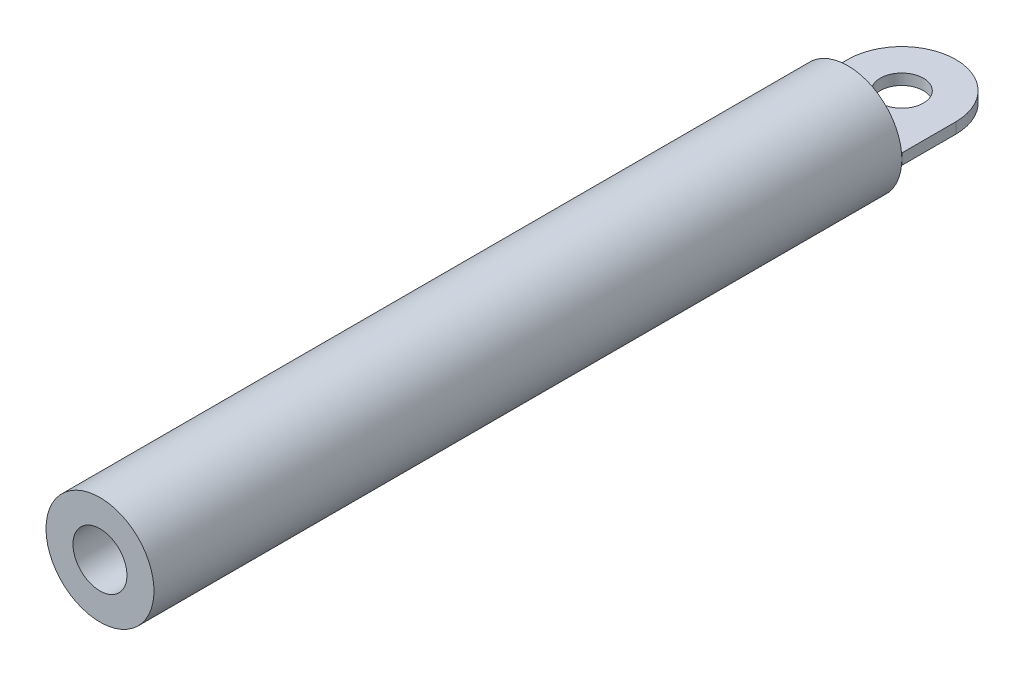
ISO-10303-21;
HEADER;
FILE_DESCRIPTION(('STEP AP214'),'2;1');
FILE_NAME('part.step','',(''),(''),'','','');
FILE_SCHEMA(('AUTOMOTIVE_DESIGN { 1 0 10303 214 1 1 1 1 }'));
ENDSEC;
DATA;
#1=APPLICATION_CONTEXT('core data for automotive mechanical design processes');
#2=APPLICATION_PROTOCOL_DEFINITION('international standard','automotive_design',2000,#1);
#3=PRODUCT_CONTEXT('',#1,'mechanical');
#4=PRODUCT('Part','Part','',(#3));
#5=PRODUCT_RELATED_PRODUCT_CATEGORY('part','',(#4));
#6=PRODUCT_DEFINITION_FORMATION('','',#4);
#7=PRODUCT_DEFINITION_CONTEXT('part definition',#1,'design');
#8=PRODUCT_DEFINITION('design','',#6,#7);
#9=PRODUCT_DEFINITION_SHAPE('','',#8);
#10=(LENGTH_UNIT() NAMED_UNIT(*) SI_UNIT(.MILLI.,.METRE.));
#11=(NAMED_UNIT(*) PLANE_ANGLE_UNIT() SI_UNIT($,.RADIAN.));
#12=(NAMED_UNIT(*) SI_UNIT($,.STERADIAN.) SOLID_ANGLE_UNIT());
#13=UNCERTAINTY_MEASURE_WITH_UNIT(LENGTH_MEASURE(1.E-05),#10,'distance_accuracy_value','');
#14=(GEOMETRIC_REPRESENTATION_CONTEXT(3) GLOBAL_UNCERTAINTY_ASSIGNED_CONTEXT((#13)) GLOBAL_UNIT_ASSIGNED_CONTEXT((#10,
#11,#12)) REPRESENTATION_CONTEXT('',''));
#15=CARTESIAN_POINT('',(0.,0.,0.));
#16=DIRECTION('',(0.,0.,1.));
#17=DIRECTION('',(1.,0.,0.));
#18=AXIS2_PLACEMENT_3D('',#15,#16,#17);
#19=CARTESIAN_POINT('',(0.,0.,3.175));
#20=DIRECTION('',(0.,0.,-1.));
#21=DIRECTION('',(-1.,0.,0.));
#22=AXIS2_PLACEMENT_3D('',#19,#20,#21);
#23=PLANE('',#22);
#24=CARTESIAN_POINT('',(0.,0.,3.175));
#25=DIRECTION('',(0.,0.,-1.));
#26=DIRECTION('',(-1.,0.,0.));
#27=AXIS2_PLACEMENT_3D('',#24,#25,#26);
#28=CIRCLE('',#27,3.175);
#29=CARTESIAN_POINT('',(3.15908511281352,-0.3175,3.175));
#30=VERTEX_POINT('',#29);
#31=CARTESIAN_POINT('',(-3.15908511281352,-0.3175,3.175));
#32=VERTEX_POINT('',#31);
#33=EDGE_CURVE('E209',#30,#32,#28,.T.);
#34=ORIENTED_EDGE('',*,*,#33,.T.);
#35=DIRECTION('',(1.,0.,0.));
#36=VECTOR('',#35,1.);
#37=CARTESIAN_POINT('',(0.,-0.3175,3.175));
#38=LINE('',#37,#36);
#39=CARTESIAN_POINT('',(-1.55542598666732,-0.3175,3.175));
#40=VERTEX_POINT('',#39);
#41=EDGE_CURVE('E11',#32,#40,#38,.T.);
#42=ORIENTED_EDGE('',*,*,#41,.T.);
#43=CARTESIAN_POINT('',(0.,0.,3.175));
#44=DIRECTION('',(0.,0.,-1.));
#45=DIRECTION('',(-1.,0.,0.));
#46=AXIS2_PLACEMENT_3D('',#43,#44,#45);
#47=CIRCLE('',#46,1.5875);
#48=CARTESIAN_POINT('',(1.55542598666732,-0.3175,3.175));
#49=VERTEX_POINT('',#48);
#50=EDGE_CURVE('E62',#49,#40,#47,.T.);
#51=ORIENTED_EDGE('',*,*,#50,.F.);
#52=EDGE_CURVE('E51',#49,#30,#38,.T.);
#53=ORIENTED_EDGE('',*,*,#52,.T.);
#54=EDGE_LOOP('',(#34,#42,#51,#53));
#55=FACE_BOUND('',#54,.T.);
#56=ADVANCED_FACE('F41',(#55),#23,.T.);
#57=CARTESIAN_POINT('',(0.,0.,0.));
#58=DIRECTION('',(0.,0.,-1.));
#59=DIRECTION('',(-1.,0.,0.));
#60=AXIS2_PLACEMENT_3D('',#57,#58,#59);
#61=CYLINDRICAL_SURFACE('',#60,1.5875);
#62=CARTESIAN_POINT('',(-1.55542598666732,0.3175,3.175));
#63=VERTEX_POINT('',#62);
#64=CARTESIAN_POINT('',(1.55542598666732,0.3175,3.175));
#65=VERTEX_POINT('',#64);
#66=EDGE_CURVE('E45',#63,#65,#47,.T.);
#67=ORIENTED_EDGE('',*,*,#66,.T.);
#68=EDGE_CURVE('E292',#65,#49,#47,.T.);
#69=ORIENTED_EDGE('',*,*,#68,.T.);
#70=ORIENTED_EDGE('',*,*,#50,.T.);
#71=EDGE_CURVE('E199',#40,#63,#47,.T.);
#72=ORIENTED_EDGE('',*,*,#71,.T.);
#73=EDGE_LOOP('',(#67,#69,#70,#72));
#74=FACE_BOUND('',#73,.T.);
#75=CARTESIAN_POINT('',(0.,0.,47.169090574));
#76=DIRECTION('',(0.,0.,-1.));
#77=DIRECTION('',(-1.,0.,0.));
#78=AXIS2_PLACEMENT_3D('',#75,#76,#77);
#79=CIRCLE('',#78,1.5875);
#80=CARTESIAN_POINT('',(-1.5875,0.,47.169090574));
#81=VERTEX_POINT('',#80);
#82=EDGE_CURVE('E188',#81,#81,#79,.T.);
#83=ORIENTED_EDGE('',*,*,#82,.F.);
#84=EDGE_LOOP('',(#83));
#85=FACE_BOUND('',#84,.T.);
#86=ADVANCED_FACE('F43',(#74,#85),#61,.F.);
#87=DIRECTION('',(1.,0.,0.));
#88=VECTOR('',#87,1.);
#89=CARTESIAN_POINT('',(0.,0.3175,3.175));
#90=LINE('',#89,#88);
#91=CARTESIAN_POINT('',(-3.15908511281352,0.3175,3.175));
#92=VERTEX_POINT('',#91);
#93=EDGE_CURVE('E229',#92,#63,#90,.T.);
#94=ORIENTED_EDGE('',*,*,#93,.F.);
#95=CARTESIAN_POINT('',(3.15908511281352,0.3175,3.175));
#96=VERTEX_POINT('',#95);
#97=EDGE_CURVE('E200',#92,#96,#28,.T.);
#98=ORIENTED_EDGE('',*,*,#97,.T.);
#99=EDGE_CURVE('E164',#65,#96,#90,.T.);
#100=ORIENTED_EDGE('',*,*,#99,.F.);
#101=ORIENTED_EDGE('',*,*,#66,.F.);
#102=EDGE_LOOP('',(#94,#98,#100,#101));
#103=FACE_BOUND('',#102,.T.);
#104=ADVANCED_FACE('F226',(#103),#23,.T.);
#105=CARTESIAN_POINT('',(0.,0.,0.));
#106=DIRECTION('',(0.,0.,-1.));
#107=DIRECTION('',(-1.,0.,0.));
#108=AXIS2_PLACEMENT_3D('',#105,#106,#107);
#109=CYLINDRICAL_SURFACE('',#108,3.175);
#110=CARTESIAN_POINT('',(0.,0.,47.169090574));
#111=DIRECTION('',(0.,0.,-1.));
#112=DIRECTION('',(-1.,0.,0.));
#113=AXIS2_PLACEMENT_3D('',#110,#111,#112);
#114=CIRCLE('',#113,3.175);
#115=CARTESIAN_POINT('',(-3.175,0.,47.169090574));
#116=VERTEX_POINT('',#115);
#117=EDGE_CURVE('E192',#116,#116,#114,.T.);
#118=ORIENTED_EDGE('',*,*,#117,.T.);
#119=EDGE_LOOP('',(#118));
#120=FACE_BOUND('',#119,.T.);
#121=CARTESIAN_POINT('',(-3.175,0.,3.175));
#122=VERTEX_POINT('',#121);
#123=EDGE_CURVE('E196',#122,#92,#28,.T.);
#124=ORIENTED_EDGE('',*,*,#123,.F.);
#125=EDGE_CURVE('E195',#32,#122,#28,.T.);
#126=ORIENTED_EDGE('',*,*,#125,.F.);
#127=ORIENTED_EDGE('',*,*,#33,.F.);
#128=CARTESIAN_POINT('',(3.175,0.,3.175));
#129=VERTEX_POINT('',#128);
#130=EDGE_CURVE('E131',#129,#30,#28,.T.);
#131=ORIENTED_EDGE('',*,*,#130,.F.);
#132=EDGE_CURVE('E206',#96,#129,#28,.T.);
#133=ORIENTED_EDGE('',*,*,#132,.F.);
#134=ORIENTED_EDGE('',*,*,#97,.F.);
#135=EDGE_LOOP('',(#124,#126,#127,#131,#133,#134));
#136=FACE_BOUND('',#135,.T.);
#137=ADVANCED_FACE('F224',(#120,#136),#109,.T.);
#138=CARTESIAN_POINT('',(0.,0.,47.169090574));
#139=DIRECTION('',(0.,0.,1.));
#140=DIRECTION('',(1.,0.,0.));
#141=AXIS2_PLACEMENT_3D('',#138,#139,#140);
#142=PLANE('',#141);
#143=ORIENTED_EDGE('',*,*,#82,.T.);
#144=EDGE_LOOP('',(#143));
#145=FACE_BOUND('',#144,.T.);
#146=ORIENTED_EDGE('',*,*,#117,.F.);
#147=EDGE_LOOP('',(#146));
#148=FACE_BOUND('',#147,.T.);
#149=ADVANCED_FACE('F270',(#145,#148),#142,.T.);
#150=CARTESIAN_POINT('',(0.,0.3175,3.175));
#151=DIRECTION('',(0.,0.,-1.));
#152=DIRECTION('',(-1.,0.,0.));
#153=AXIS2_PLACEMENT_3D('',#150,#151,#152);
#154=PLANE('',#153);
#155=CARTESIAN_POINT('',(3.175,0.3175,3.175));
#156=VERTEX_POINT('',#155);
#157=EDGE_CURVE('E157',#96,#156,#90,.T.);
#158=ORIENTED_EDGE('',*,*,#157,.F.);
#159=ORIENTED_EDGE('',*,*,#132,.T.);
#160=DIRECTION('',(0.,-1.,0.));
#161=VECTOR('',#160,1.);
#162=CARTESIAN_POINT('',(3.175,0.3175,3.175));
#163=LINE('',#162,#161);
#164=EDGE_CURVE('E122',#156,#129,#163,.T.);
#165=ORIENTED_EDGE('',*,*,#164,.F.);
#166=EDGE_LOOP('',(#158,#159,#165));
#167=FACE_BOUND('',#166,.T.);
#168=ADVANCED_FACE('F220',(#167),#154,.F.);
#169=CARTESIAN_POINT('',(3.175,-0.3175,3.175));
#170=VERTEX_POINT('',#169);
#171=EDGE_CURVE('E114',#129,#170,#163,.T.);
#172=ORIENTED_EDGE('',*,*,#171,.F.);
#173=ORIENTED_EDGE('',*,*,#130,.T.);
#174=EDGE_CURVE('E129',#30,#170,#38,.T.);
#175=ORIENTED_EDGE('',*,*,#174,.T.);
#176=EDGE_LOOP('',(#172,#173,#175));
#177=FACE_BOUND('',#176,.T.);
#178=ADVANCED_FACE('F130',(#177),#154,.F.);
#179=DIRECTION('',(0.,-1.,0.));
#180=VECTOR('',#179,1.);
#181=CARTESIAN_POINT('',(-3.175,0.3175,3.175));
#182=LINE('',#181,#180);
#183=CARTESIAN_POINT('',(-3.175,0.3175,3.175));
#184=VERTEX_POINT('',#183);
#185=EDGE_CURVE('E178',#184,#122,#182,.T.);
#186=ORIENTED_EDGE('',*,*,#185,.T.);
#187=ORIENTED_EDGE('',*,*,#123,.T.);
#188=EDGE_CURVE('E158',#184,#92,#90,.T.);
#189=ORIENTED_EDGE('',*,*,#188,.F.);
#190=EDGE_LOOP('',(#186,#187,#189));
#191=FACE_BOUND('',#190,.T.);
#192=ADVANCED_FACE('F249',(#191),#154,.F.);
#193=CARTESIAN_POINT('',(-3.175,-0.3175,3.175));
#194=VERTEX_POINT('',#193);
#195=EDGE_CURVE('E135',#194,#32,#38,.T.);
#196=ORIENTED_EDGE('',*,*,#195,.T.);
#197=ORIENTED_EDGE('',*,*,#125,.T.);
#198=EDGE_CURVE('E177',#122,#194,#182,.T.);
#199=ORIENTED_EDGE('',*,*,#198,.T.);
#200=EDGE_LOOP('',(#196,#197,#199));
#201=FACE_BOUND('',#200,.T.);
#202=ADVANCED_FACE('F251',(#201),#154,.F.);
#203=ORIENTED_EDGE('',*,*,#68,.F.);
#204=EDGE_CURVE('E163',#63,#65,#90,.T.);
#205=ORIENTED_EDGE('',*,*,#204,.F.);
#206=ORIENTED_EDGE('',*,*,#71,.F.);
#207=EDGE_CURVE('E53',#40,#49,#38,.T.);
#208=ORIENTED_EDGE('',*,*,#207,.T.);
#209=EDGE_LOOP('',(#203,#205,#206,#208));
#210=FACE_BOUND('',#209,.T.);
#211=ADVANCED_FACE('F257',(#210),#154,.F.);
#212=CARTESIAN_POINT('',(3.175,0.3175,0.));
#213=DIRECTION('',(1.,0.,0.));
#214=DIRECTION('',(0.,0.,-1.));
#215=AXIS2_PLACEMENT_3D('',#212,#213,#214);
#216=PLANE('',#215);
#217=ORIENTED_EDGE('',*,*,#164,.T.);
#218=ORIENTED_EDGE('',*,*,#171,.T.);
#219=DIRECTION('',(0.,0.,1.));
#220=VECTOR('',#219,1.);
#221=CARTESIAN_POINT('',(3.175,-0.3175,0.));
#222=LINE('',#221,#220);
#223=CARTESIAN_POINT('',(3.175,-0.3175,0.));
#224=VERTEX_POINT('',#223);
#225=EDGE_CURVE('E118',#224,#170,#222,.T.);
#226=ORIENTED_EDGE('',*,*,#225,.F.);
#227=DIRECTION('',(0.,-1.,0.));
#228=VECTOR('',#227,1.);
#229=CARTESIAN_POINT('',(3.175,0.3175,0.));
#230=LINE('',#229,#228);
#231=CARTESIAN_POINT('',(3.175,0.3175,0.));
#232=VERTEX_POINT('',#231);
#233=EDGE_CURVE('E126',#232,#224,#230,.T.);
#234=ORIENTED_EDGE('',*,*,#233,.F.);
#235=DIRECTION('',(0.,0.,1.));
#236=VECTOR('',#235,1.);
#237=CARTESIAN_POINT('',(3.175,0.3175,0.));
#238=LINE('',#237,#236);
#239=EDGE_CURVE('E162',#232,#156,#238,.T.);
#240=ORIENTED_EDGE('',*,*,#239,.T.);
#241=EDGE_LOOP('',(#217,#218,#226,#234,#240));
#242=FACE_BOUND('',#241,.T.);
#243=ADVANCED_FACE('F116',(#242),#216,.T.);
#244=CARTESIAN_POINT('',(0.,0.3175,0.));
#245=DIRECTION('',(0.,-1.,0.));
#246=DIRECTION('',(0.,0.,-1.));
#247=AXIS2_PLACEMENT_3D('',#244,#245,#246);
#248=CYLINDRICAL_SURFACE('',#247,3.175);
#249=ORIENTED_EDGE('',*,*,#233,.T.);
#250=CARTESIAN_POINT('',(0.,-0.3175,0.));
#251=DIRECTION('',(0.,1.,0.));
#252=DIRECTION('',(0.,0.,1.));
#253=AXIS2_PLACEMENT_3D('',#250,#251,#252);
#254=CIRCLE('',#253,3.175);
#255=CARTESIAN_POINT('',(-3.175,-0.3175,0.));
#256=VERTEX_POINT('',#255);
#257=EDGE_CURVE('E141',#224,#256,#254,.T.);
#258=ORIENTED_EDGE('',*,*,#257,.T.);
#259=DIRECTION('',(0.,-1.,0.));
#260=VECTOR('',#259,1.);
#261=CARTESIAN_POINT('',(-3.175,0.3175,0.));
#262=LINE('',#261,#260);
#263=CARTESIAN_POINT('',(-3.175,0.3175,0.));
#264=VERTEX_POINT('',#263);
#265=EDGE_CURVE('E182',#264,#256,#262,.T.);
#266=ORIENTED_EDGE('',*,*,#265,.F.);
#267=CARTESIAN_POINT('',(0.,0.3175,0.));
#268=DIRECTION('',(0.,1.,0.));
#269=DIRECTION('',(0.,0.,1.));
#270=AXIS2_PLACEMENT_3D('',#267,#268,#269);
#271=CIRCLE('',#270,3.175);
#272=EDGE_CURVE('E167',#232,#264,#271,.T.);
#273=ORIENTED_EDGE('',*,*,#272,.F.);
#274=EDGE_LOOP('',(#249,#258,#266,#273));
#275=FACE_BOUND('',#274,.T.);
#276=ADVANCED_FACE('F244',(#275),#248,.T.);
#277=CARTESIAN_POINT('',(-3.175,0.3175,0.));
#278=DIRECTION('',(1.,0.,0.));
#279=DIRECTION('',(0.,0.,-1.));
#280=AXIS2_PLACEMENT_3D('',#277,#278,#279);
#281=PLANE('',#280);
#282=ORIENTED_EDGE('',*,*,#265,.T.);
#283=DIRECTION('',(0.,0.,1.));
#284=VECTOR('',#283,1.);
#285=CARTESIAN_POINT('',(-3.175,-0.3175,0.));
#286=LINE('',#285,#284);
#287=EDGE_CURVE('E146',#256,#194,#286,.T.);
#288=ORIENTED_EDGE('',*,*,#287,.T.);
#289=ORIENTED_EDGE('',*,*,#198,.F.);
#290=ORIENTED_EDGE('',*,*,#185,.F.);
#291=DIRECTION('',(0.,0.,1.));
#292=VECTOR('',#291,1.);
#293=CARTESIAN_POINT('',(-3.175,0.3175,0.));
#294=LINE('',#293,#292);
#295=EDGE_CURVE('E170',#264,#184,#294,.T.);
#296=ORIENTED_EDGE('',*,*,#295,.F.);
#297=EDGE_LOOP('',(#282,#288,#289,#290,#296));
#298=FACE_BOUND('',#297,.T.);
#299=ADVANCED_FACE('F248',(#298),#281,.F.);
#300=CARTESIAN_POINT('',(0.,0.3175,0.));
#301=DIRECTION('',(0.,-1.,0.));
#302=DIRECTION('',(0.,0.,-1.));
#303=AXIS2_PLACEMENT_3D('',#300,#301,#302);
#304=CYLINDRICAL_SURFACE('',#303,1.27);
#305=CARTESIAN_POINT('',(0.,0.3175,0.));
#306=DIRECTION('',(0.,1.,0.));
#307=DIRECTION('',(0.,0.,1.));
#308=AXIS2_PLACEMENT_3D('',#305,#306,#307);
#309=CIRCLE('',#308,1.27);
#310=CARTESIAN_POINT('',(0.,0.3175,1.27));
#311=VERTEX_POINT('',#310);
#312=EDGE_CURVE('E173',#311,#311,#309,.T.);
#313=ORIENTED_EDGE('',*,*,#312,.T.);
#314=EDGE_LOOP('',(#313));
#315=FACE_BOUND('',#314,.T.);
#316=CARTESIAN_POINT('',(0.,-0.3175,0.));
#317=DIRECTION('',(0.,1.,0.));
#318=DIRECTION('',(0.,0.,1.));
#319=AXIS2_PLACEMENT_3D('',#316,#317,#318);
#320=CIRCLE('',#319,1.27);
#321=CARTESIAN_POINT('',(0.,-0.3175,1.27));
#322=VERTEX_POINT('',#321);
#323=EDGE_CURVE('E153',#322,#322,#320,.T.);
#324=ORIENTED_EDGE('',*,*,#323,.F.);
#325=EDGE_LOOP('',(#324));
#326=FACE_BOUND('',#325,.T.);
#327=ADVANCED_FACE('F307',(#315,#326),#304,.F.);
#328=CARTESIAN_POINT('',(0.,0.3175,0.));
#329=DIRECTION('',(0.,1.,0.));
#330=DIRECTION('',(0.,0.,1.));
#331=AXIS2_PLACEMENT_3D('',#328,#329,#330);
#332=PLANE('',#331);
#333=ORIENTED_EDGE('',*,*,#188,.T.);
#334=ORIENTED_EDGE('',*,*,#93,.T.);
#335=ORIENTED_EDGE('',*,*,#204,.T.);
#336=ORIENTED_EDGE('',*,*,#99,.T.);
#337=ORIENTED_EDGE('',*,*,#157,.T.);
#338=ORIENTED_EDGE('',*,*,#239,.F.);
#339=ORIENTED_EDGE('',*,*,#272,.T.);
#340=ORIENTED_EDGE('',*,*,#295,.T.);
#341=EDGE_LOOP('',(#333,#334,#335,#336,#337,#338,#339,#340));
#342=FACE_BOUND('',#341,.T.);
#343=ORIENTED_EDGE('',*,*,#312,.F.);
#344=EDGE_LOOP('',(#343));
#345=FACE_BOUND('',#344,.T.);
#346=ADVANCED_FACE('F239',(#342,#345),#332,.T.);
#347=CARTESIAN_POINT('',(0.,-0.3175,0.));
#348=DIRECTION('',(0.,1.,0.));
#349=DIRECTION('',(0.,0.,1.));
#350=AXIS2_PLACEMENT_3D('',#347,#348,#349);
#351=PLANE('',#350);
#352=ORIENTED_EDGE('',*,*,#195,.F.);
#353=ORIENTED_EDGE('',*,*,#287,.F.);
#354=ORIENTED_EDGE('',*,*,#257,.F.);
#355=ORIENTED_EDGE('',*,*,#225,.T.);
#356=ORIENTED_EDGE('',*,*,#174,.F.);
#357=ORIENTED_EDGE('',*,*,#52,.F.);
#358=ORIENTED_EDGE('',*,*,#207,.F.);
#359=ORIENTED_EDGE('',*,*,#41,.F.);
#360=EDGE_LOOP('',(#352,#353,#354,#355,#356,#357,#358,#359));
#361=FACE_BOUND('',#360,.T.);
#362=ORIENTED_EDGE('',*,*,#323,.T.);
#363=EDGE_LOOP('',(#362));
#364=FACE_BOUND('',#363,.T.);
#365=ADVANCED_FACE('F137',(#361,#364),#351,.F.);
#366=CLOSED_SHELL('',(#56,#86,#104,#137,#149,#168,#178,#192,#202,#211,#243,#276,#299,#327,#346,#365));
#367=MANIFOLD_SOLID_BREP('B2',#366);
#368=ADVANCED_BREP_SHAPE_REPRESENTATION('',(#18,#367),#14);
#369=SHAPE_DEFINITION_REPRESENTATION(#9,#368);
ENDSEC;
END-ISO-10303-21;
